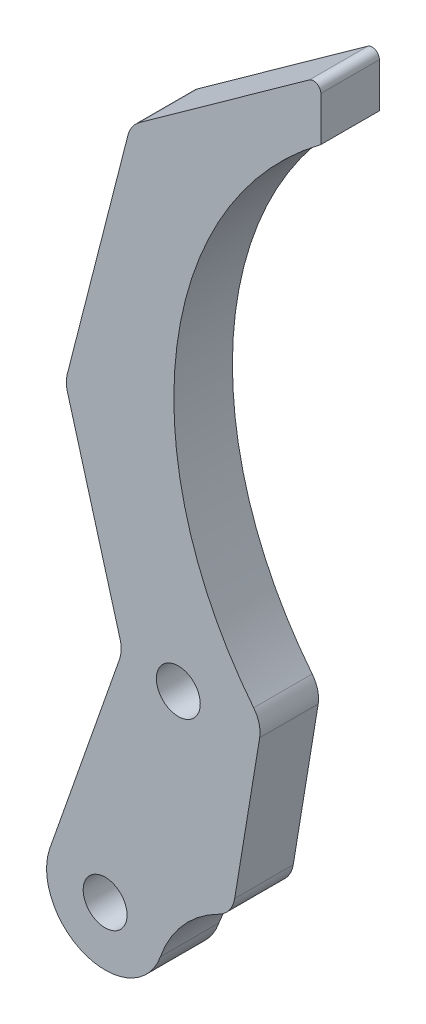
ISO-10303-21;
HEADER;
FILE_DESCRIPTION(('STEP AP214'),'2;1');
FILE_NAME('part.step','',(''),(''),'','','');
FILE_SCHEMA(('AUTOMOTIVE_DESIGN { 1 0 10303 214 1 1 1 1 }'));
ENDSEC;
DATA;
#1=APPLICATION_CONTEXT('core data for automotive mechanical design processes');
#2=APPLICATION_PROTOCOL_DEFINITION('international standard','automotive_design',2000,#1);
#3=PRODUCT_CONTEXT('',#1,'mechanical');
#4=PRODUCT('Part','Part','',(#3));
#5=PRODUCT_RELATED_PRODUCT_CATEGORY('part','',(#4));
#6=PRODUCT_DEFINITION_FORMATION('','',#4);
#7=PRODUCT_DEFINITION_CONTEXT('part definition',#1,'design');
#8=PRODUCT_DEFINITION('design','',#6,#7);
#9=PRODUCT_DEFINITION_SHAPE('','',#8);
#10=(LENGTH_UNIT() NAMED_UNIT(*) SI_UNIT(.MILLI.,.METRE.));
#11=(NAMED_UNIT(*) PLANE_ANGLE_UNIT() SI_UNIT($,.RADIAN.));
#12=(NAMED_UNIT(*) SI_UNIT($,.STERADIAN.) SOLID_ANGLE_UNIT());
#13=UNCERTAINTY_MEASURE_WITH_UNIT(LENGTH_MEASURE(1.E-05),#10,'distance_accuracy_value','');
#14=(GEOMETRIC_REPRESENTATION_CONTEXT(3) GLOBAL_UNCERTAINTY_ASSIGNED_CONTEXT((#13)) GLOBAL_UNIT_ASSIGNED_CONTEXT((#10,
#11,#12)) REPRESENTATION_CONTEXT('',''));
#15=CARTESIAN_POINT('',(0.,0.,0.));
#16=DIRECTION('',(0.,0.,1.));
#17=DIRECTION('',(1.,0.,0.));
#18=AXIS2_PLACEMENT_3D('',#15,#16,#17);
#19=CARTESIAN_POINT('',(3.02913563456561,50.8087252701093,4.));
#20=DIRECTION('',(0.,0.,-1.));
#21=DIRECTION('',(-1.,0.,0.));
#22=AXIS2_PLACEMENT_3D('',#19,#20,#21);
#23=PLANE('',#22);
#24=CARTESIAN_POINT('',(3.02913563456561,50.8087252701093,4.));
#25=DIRECTION('',(0.,0.,-1.));
#26=DIRECTION('',(-1.,0.,0.));
#27=AXIS2_PLACEMENT_3D('',#24,#25,#26);
#28=CIRCLE('',#27,25.);
#29=CARTESIAN_POINT('',(-16.5198445807297,35.2254851531762,4.));
#30=VERTEX_POINT('',#29);
#31=CARTESIAN_POINT('',(-11.927927268659,70.8408561929288,4.));
#32=VERTEX_POINT('',#31);
#33=EDGE_CURVE('E207',#30,#32,#28,.T.);
#34=ORIENTED_EDGE('',*,*,#33,.T.);
#35=DIRECTION('',(0.,1.,0.));
#36=VECTOR('',#35,1.);
#37=CARTESIAN_POINT('',(-11.927927268659,73.8667263637474,4.));
#38=LINE('',#37,#36);
#39=CARTESIAN_POINT('',(-11.927927268659,73.8667263637474,4.));
#40=VERTEX_POINT('',#39);
#41=EDGE_CURVE('E120',#32,#40,#38,.T.);
#42=ORIENTED_EDGE('',*,*,#41,.T.);
#43=CARTESIAN_POINT('',(-12.427927268659,73.8667263637474,4.));
#44=DIRECTION('',(0.,0.,1.));
#45=DIRECTION('',(-1.,0.,0.));
#46=AXIS2_PLACEMENT_3D('',#43,#44,#45);
#47=CIRCLE('',#46,0.499999999999995);
#48=CARTESIAN_POINT('',(-12.7194078185277,74.2729763964221,4.));
#49=VERTEX_POINT('',#48);
#50=EDGE_CURVE('E243',#40,#49,#47,.T.);
#51=ORIENTED_EDGE('',*,*,#50,.T.);
#52=DIRECTION('',(-0.812500065349455,-0.58296109973748,0.));
#53=VECTOR('',#52,1.);
#54=CARTESIAN_POINT('',(-24.3364766359972,65.9378395732082,4.));
#55=LINE('',#54,#53);
#56=CARTESIAN_POINT('',(-24.3364766359972,65.9378395732082,4.));
#57=VERTEX_POINT('',#56);
#58=EDGE_CURVE('E262',#49,#57,#55,.T.);
#59=ORIENTED_EDGE('',*,*,#58,.T.);
#60=CARTESIAN_POINT('',(-23.1705544365222,64.3128394425093,4.));
#61=DIRECTION('',(0.,0.,1.));
#62=DIRECTION('',(-1.,0.,0.));
#63=AXIS2_PLACEMENT_3D('',#60,#61,#62);
#64=CIRCLE('',#63,2.);
#65=CARTESIAN_POINT('',(-25.1082326082913,64.8082214190178,4.));
#66=VERTEX_POINT('',#65);
#67=EDGE_CURVE('E259',#57,#66,#64,.T.);
#68=ORIENTED_EDGE('',*,*,#67,.T.);
#69=DIRECTION('',(-0.247690988254264,-0.968839085884558,0.));
#70=VECTOR('',#69,1.);
#71=CARTESIAN_POINT('',(-29.2536289022766,48.5935743525241,4.));
#72=LINE('',#71,#70);
#73=CARTESIAN_POINT('',(-29.2536289022766,48.5935743525241,4.));
#74=VERTEX_POINT('',#73);
#75=EDGE_CURVE('E261',#66,#74,#72,.T.);
#76=ORIENTED_EDGE('',*,*,#75,.T.);
#77=CARTESIAN_POINT('',(-27.3159507305075,48.0981923760155,4.));
#78=DIRECTION('',(0.,0.,1.));
#79=DIRECTION('',(-1.,0.,0.));
#80=AXIS2_PLACEMENT_3D('',#77,#78,#79);
#81=CIRCLE('',#80,2.);
#82=CARTESIAN_POINT('',(-29.2417202398724,47.5583666663643,4.));
#83=VERTEX_POINT('',#82);
#84=EDGE_CURVE('E264',#74,#83,#81,.T.);
#85=ORIENTED_EDGE('',*,*,#84,.T.);
#86=DIRECTION('',(0.269912854825616,-0.962884754682452,0.));
#87=VECTOR('',#86,1.);
#88=CARTESIAN_POINT('',(-25.6428361003143,34.7197389022744,4.));
#89=LINE('',#88,#87);
#90=CARTESIAN_POINT('',(-25.6428361003143,34.7197389022744,4.));
#91=VERTEX_POINT('',#90);
#92=EDGE_CURVE('E270',#83,#91,#89,.T.);
#93=ORIENTED_EDGE('',*,*,#92,.T.);
#94=CARTESIAN_POINT('',(-27.5686056096793,34.1799131926231,4.));
#95=DIRECTION('',(0.,0.,-1.));
#96=DIRECTION('',(1.,0.,0.));
#97=AXIS2_PLACEMENT_3D('',#94,#95,#96);
#98=CIRCLE('',#97,2.);
#99=CARTESIAN_POINT('',(-25.6814762724612,33.5175365138287,4.));
#100=VERTEX_POINT('',#99);
#101=EDGE_CURVE('E272',#91,#100,#98,.T.);
#102=ORIENTED_EDGE('',*,*,#101,.T.);
#103=DIRECTION('',(-0.331188339397233,-0.943564668609048,0.));
#104=VECTOR('',#103,1.);
#105=CARTESIAN_POINT('',(-30.4404547988141,19.9590760791758,4.));
#106=LINE('',#105,#104);
#107=CARTESIAN_POINT('',(-30.4404547988141,19.9590760791758,4.));
#108=VERTEX_POINT('',#107);
#109=EDGE_CURVE('E274',#100,#108,#106,.T.);
#110=ORIENTED_EDGE('',*,*,#109,.T.);
#111=CARTESIAN_POINT('',(-26.6661944751087,18.6343221426984,4.));
#112=DIRECTION('',(0.,0.,1.));
#113=DIRECTION('',(1.,0.,0.));
#114=AXIS2_PLACEMENT_3D('',#111,#112,#113);
#115=CIRCLE('',#114,4.00000174791326);
#116=CARTESIAN_POINT('',(-22.8919341514033,17.309568206221,4.));
#117=VERTEX_POINT('',#116);
#118=EDGE_CURVE('E276',#108,#117,#115,.T.);
#119=ORIENTED_EDGE('',*,*,#118,.T.);
#120=CARTESIAN_POINT('',(-15.3434168025309,14.6600614910431,4.));
#121=DIRECTION('',(0.,0.,-1.));
#122=DIRECTION('',(-1.,0.,0.));
#123=AXIS2_PLACEMENT_3D('',#120,#121,#122);
#124=CIRCLE('',#123,8.);
#125=CARTESIAN_POINT('',(-18.8990856555673,21.8264566104561,4.));
#126=VERTEX_POINT('',#125);
#127=EDGE_CURVE('E160',#117,#126,#124,.T.);
#128=ORIENTED_EDGE('',*,*,#127,.T.);
#129=CARTESIAN_POINT('',(-19.7880028688264,23.6180553903094,4.));
#130=DIRECTION('',(0.,0.,1.));
#131=DIRECTION('',(1.,0.,0.));
#132=AXIS2_PLACEMENT_3D('',#129,#130,#131);
#133=CIRCLE('',#132,2.);
#134=CARTESIAN_POINT('',(-17.8145227633955,23.2934382720478,4.));
#135=VERTEX_POINT('',#134);
#136=EDGE_CURVE('E154',#126,#135,#133,.T.);
#137=ORIENTED_EDGE('',*,*,#136,.T.);
#138=DIRECTION('',(0.162308559130773,0.986740052715452,0.));
#139=VECTOR('',#138,1.);
#140=CARTESIAN_POINT('',(-16.1102828925224,33.65420882556,4.));
#141=LINE('',#140,#139);
#142=CARTESIAN_POINT('',(-16.1102828925224,33.65420882556,4.));
#143=VERTEX_POINT('',#142);
#144=EDGE_CURVE('E158',#135,#143,#141,.T.);
#145=ORIENTED_EDGE('',*,*,#144,.T.);
#146=CARTESIAN_POINT('',(-18.0837629979533,33.9788259438216,4.));
#147=DIRECTION('',(0.,0.,1.));
#148=DIRECTION('',(1.,0.,0.));
#149=AXIS2_PLACEMENT_3D('',#146,#147,#148);
#150=CIRCLE('',#149,2.);
#151=EDGE_CURVE('E56',#143,#30,#150,.T.);
#152=ORIENTED_EDGE('',*,*,#151,.T.);
#153=EDGE_LOOP('',(#34,#42,#51,#59,#68,#76,#85,#93,#102,#110,#119,#128,#137,#145,#152));
#154=FACE_BOUND('',#153,.T.);
#155=CARTESIAN_POINT('',(-26.6661944751087,18.6343221426984,4.));
#156=DIRECTION('',(0.,0.,1.));
#157=DIRECTION('',(-1.,0.,0.));
#158=AXIS2_PLACEMENT_3D('',#155,#156,#157);
#159=CIRCLE('',#158,1.5);
#160=CARTESIAN_POINT('',(-28.1661944751087,18.6343221426984,4.));
#161=VERTEX_POINT('',#160);
#162=EDGE_CURVE('E182',#161,#161,#159,.T.);
#163=ORIENTED_EDGE('',*,*,#162,.F.);
#164=EDGE_LOOP('',(#163));
#165=FACE_BOUND('',#164,.T.);
#166=CARTESIAN_POINT('',(-21.6661944751087,33.6343221426984,4.));
#167=DIRECTION('',(0.,0.,1.));
#168=DIRECTION('',(1.,0.,0.));
#169=AXIS2_PLACEMENT_3D('',#166,#167,#168);
#170=CIRCLE('',#169,1.5);
#171=CARTESIAN_POINT('',(-20.1661944751087,33.6343221426984,4.));
#172=VERTEX_POINT('',#171);
#173=EDGE_CURVE('E317',#172,#172,#170,.T.);
#174=ORIENTED_EDGE('',*,*,#173,.F.);
#175=EDGE_LOOP('',(#174));
#176=FACE_BOUND('',#175,.T.);
#177=ADVANCED_FACE('F39',(#154,#165,#176),#23,.F.);
#178=CARTESIAN_POINT('',(3.02913563456561,50.8087252701093,0.));
#179=DIRECTION('',(0.,0.,-1.));
#180=DIRECTION('',(-1.,0.,0.));
#181=AXIS2_PLACEMENT_3D('',#178,#179,#180);
#182=PLANE('',#181);
#183=CARTESIAN_POINT('',(-26.6661944751087,18.6343221426984,0.));
#184=DIRECTION('',(0.,0.,1.));
#185=DIRECTION('',(-1.,0.,0.));
#186=AXIS2_PLACEMENT_3D('',#183,#184,#185);
#187=CIRCLE('',#186,1.5);
#188=CARTESIAN_POINT('',(-28.1661944751087,18.6343221426984,0.));
#189=VERTEX_POINT('',#188);
#190=EDGE_CURVE('E322',#189,#189,#187,.T.);
#191=ORIENTED_EDGE('',*,*,#190,.T.);
#192=EDGE_LOOP('',(#191));
#193=FACE_BOUND('',#192,.T.);
#194=CARTESIAN_POINT('',(3.02913563456561,50.8087252701093,0.));
#195=DIRECTION('',(0.,0.,-1.));
#196=DIRECTION('',(-1.,0.,0.));
#197=AXIS2_PLACEMENT_3D('',#194,#195,#196);
#198=CIRCLE('',#197,25.);
#199=CARTESIAN_POINT('',(-16.5198445807297,35.2254851531762,0.));
#200=VERTEX_POINT('',#199);
#201=CARTESIAN_POINT('',(-11.927927268659,70.8408561929288,0.));
#202=VERTEX_POINT('',#201);
#203=EDGE_CURVE('E178',#200,#202,#198,.T.);
#204=ORIENTED_EDGE('',*,*,#203,.F.);
#205=CARTESIAN_POINT('',(-18.0837629979533,33.9788259438216,0.));
#206=DIRECTION('',(0.,0.,1.));
#207=DIRECTION('',(1.,0.,0.));
#208=AXIS2_PLACEMENT_3D('',#205,#206,#207);
#209=CIRCLE('',#208,2.);
#210=CARTESIAN_POINT('',(-16.1102828925224,33.65420882556,0.));
#211=VERTEX_POINT('',#210);
#212=EDGE_CURVE('E112',#211,#200,#209,.T.);
#213=ORIENTED_EDGE('',*,*,#212,.F.);
#214=DIRECTION('',(0.162308559130773,0.986740052715452,0.));
#215=VECTOR('',#214,1.);
#216=CARTESIAN_POINT('',(-16.1102828925224,33.65420882556,0.));
#217=LINE('',#216,#215);
#218=CARTESIAN_POINT('',(-17.8145227633955,23.2934382720478,0.));
#219=VERTEX_POINT('',#218);
#220=EDGE_CURVE('E106',#219,#211,#217,.T.);
#221=ORIENTED_EDGE('',*,*,#220,.F.);
#222=CARTESIAN_POINT('',(-19.7880028688264,23.6180553903094,0.));
#223=DIRECTION('',(0.,0.,1.));
#224=DIRECTION('',(1.,0.,0.));
#225=AXIS2_PLACEMENT_3D('',#222,#223,#224);
#226=CIRCLE('',#225,2.);
#227=CARTESIAN_POINT('',(-18.8990856555673,21.8264566104561,0.));
#228=VERTEX_POINT('',#227);
#229=EDGE_CURVE('E168',#228,#219,#226,.T.);
#230=ORIENTED_EDGE('',*,*,#229,.F.);
#231=CARTESIAN_POINT('',(-15.3434168025309,14.6600614910431,0.));
#232=DIRECTION('',(0.,0.,-1.));
#233=DIRECTION('',(-1.,0.,0.));
#234=AXIS2_PLACEMENT_3D('',#231,#232,#233);
#235=CIRCLE('',#234,8.);
#236=CARTESIAN_POINT('',(-22.8919341514033,17.309568206221,0.));
#237=VERTEX_POINT('',#236);
#238=EDGE_CURVE('E202',#237,#228,#235,.T.);
#239=ORIENTED_EDGE('',*,*,#238,.F.);
#240=CARTESIAN_POINT('',(-26.6661944751087,18.6343221426984,0.));
#241=DIRECTION('',(0.,0.,1.));
#242=DIRECTION('',(1.,0.,0.));
#243=AXIS2_PLACEMENT_3D('',#240,#241,#242);
#244=CIRCLE('',#243,4.00000174791326);
#245=CARTESIAN_POINT('',(-30.4404547988141,19.9590760791758,0.));
#246=VERTEX_POINT('',#245);
#247=EDGE_CURVE('E200',#246,#237,#244,.T.);
#248=ORIENTED_EDGE('',*,*,#247,.F.);
#249=DIRECTION('',(-0.331188339397233,-0.943564668609048,0.));
#250=VECTOR('',#249,1.);
#251=CARTESIAN_POINT('',(-30.4404547988141,19.9590760791758,0.));
#252=LINE('',#251,#250);
#253=CARTESIAN_POINT('',(-25.6814762724612,33.5175365138287,0.));
#254=VERTEX_POINT('',#253);
#255=EDGE_CURVE('E198',#254,#246,#252,.T.);
#256=ORIENTED_EDGE('',*,*,#255,.F.);
#257=CARTESIAN_POINT('',(-27.5686056096793,34.1799131926231,0.));
#258=DIRECTION('',(0.,0.,-1.));
#259=DIRECTION('',(1.,0.,0.));
#260=AXIS2_PLACEMENT_3D('',#257,#258,#259);
#261=CIRCLE('',#260,2.);
#262=CARTESIAN_POINT('',(-25.6428361003143,34.7197389022744,0.));
#263=VERTEX_POINT('',#262);
#264=EDGE_CURVE('E196',#263,#254,#261,.T.);
#265=ORIENTED_EDGE('',*,*,#264,.F.);
#266=DIRECTION('',(0.269912854825616,-0.962884754682452,0.));
#267=VECTOR('',#266,1.);
#268=CARTESIAN_POINT('',(-25.6428361003143,34.7197389022744,0.));
#269=LINE('',#268,#267);
#270=CARTESIAN_POINT('',(-29.2417202398724,47.5583666663643,0.));
#271=VERTEX_POINT('',#270);
#272=EDGE_CURVE('E194',#271,#263,#269,.T.);
#273=ORIENTED_EDGE('',*,*,#272,.F.);
#274=CARTESIAN_POINT('',(-27.3159507305075,48.0981923760155,0.));
#275=DIRECTION('',(0.,0.,1.));
#276=DIRECTION('',(-1.,0.,0.));
#277=AXIS2_PLACEMENT_3D('',#274,#275,#276);
#278=CIRCLE('',#277,2.);
#279=CARTESIAN_POINT('',(-29.2536289022766,48.5935743525241,0.));
#280=VERTEX_POINT('',#279);
#281=EDGE_CURVE('E192',#280,#271,#278,.T.);
#282=ORIENTED_EDGE('',*,*,#281,.F.);
#283=DIRECTION('',(-0.247690988254264,-0.968839085884558,0.));
#284=VECTOR('',#283,1.);
#285=CARTESIAN_POINT('',(-29.2536289022766,48.5935743525241,0.));
#286=LINE('',#285,#284);
#287=CARTESIAN_POINT('',(-25.1082326082913,64.8082214190178,0.));
#288=VERTEX_POINT('',#287);
#289=EDGE_CURVE('E190',#288,#280,#286,.T.);
#290=ORIENTED_EDGE('',*,*,#289,.F.);
#291=CARTESIAN_POINT('',(-23.1705544365222,64.3128394425093,0.));
#292=DIRECTION('',(0.,0.,1.));
#293=DIRECTION('',(-1.,0.,0.));
#294=AXIS2_PLACEMENT_3D('',#291,#292,#293);
#295=CIRCLE('',#294,2.);
#296=CARTESIAN_POINT('',(-24.3364766359972,65.9378395732082,0.));
#297=VERTEX_POINT('',#296);
#298=EDGE_CURVE('E188',#297,#288,#295,.T.);
#299=ORIENTED_EDGE('',*,*,#298,.F.);
#300=DIRECTION('',(-0.812500065349455,-0.58296109973748,0.));
#301=VECTOR('',#300,1.);
#302=CARTESIAN_POINT('',(-24.3364766359972,65.9378395732082,0.));
#303=LINE('',#302,#301);
#304=CARTESIAN_POINT('',(-12.7194078185277,74.2729763964221,0.));
#305=VERTEX_POINT('',#304);
#306=EDGE_CURVE('E186',#305,#297,#303,.T.);
#307=ORIENTED_EDGE('',*,*,#306,.F.);
#308=CARTESIAN_POINT('',(-12.427927268659,73.8667263637474,0.));
#309=DIRECTION('',(0.,0.,1.));
#310=DIRECTION('',(-1.,0.,0.));
#311=AXIS2_PLACEMENT_3D('',#308,#309,#310);
#312=CIRCLE('',#311,0.499999999999995);
#313=CARTESIAN_POINT('',(-11.927927268659,73.8667263637474,0.));
#314=VERTEX_POINT('',#313);
#315=EDGE_CURVE('E184',#314,#305,#312,.T.);
#316=ORIENTED_EDGE('',*,*,#315,.F.);
#317=DIRECTION('',(0.,1.,0.));
#318=VECTOR('',#317,1.);
#319=CARTESIAN_POINT('',(-11.927927268659,73.8667263637474,0.));
#320=LINE('',#319,#318);
#321=EDGE_CURVE('E181',#202,#314,#320,.T.);
#322=ORIENTED_EDGE('',*,*,#321,.F.);
#323=EDGE_LOOP('',(#204,#213,#221,#230,#239,#248,#256,#265,#273,#282,#290,#299,#307,#316,#322));
#324=FACE_BOUND('',#323,.T.);
#325=CARTESIAN_POINT('',(-21.6661944751087,33.6343221426984,0.));
#326=DIRECTION('',(0.,0.,1.));
#327=DIRECTION('',(1.,0.,0.));
#328=AXIS2_PLACEMENT_3D('',#325,#326,#327);
#329=CIRCLE('',#328,1.5);
#330=CARTESIAN_POINT('',(-20.1661944751087,33.6343221426984,0.));
#331=VERTEX_POINT('',#330);
#332=EDGE_CURVE('E320',#331,#331,#329,.T.);
#333=ORIENTED_EDGE('',*,*,#332,.T.);
#334=EDGE_LOOP('',(#333));
#335=FACE_BOUND('',#334,.T.);
#336=ADVANCED_FACE('F247',(#193,#324,#335),#182,.T.);
#337=CARTESIAN_POINT('',(3.02913563456561,50.8087252701093,4.));
#338=DIRECTION('',(0.,0.,-1.));
#339=DIRECTION('',(-1.,0.,0.));
#340=AXIS2_PLACEMENT_3D('',#337,#338,#339);
#341=CYLINDRICAL_SURFACE('',#340,25.);
#342=ORIENTED_EDGE('',*,*,#203,.T.);
#343=DIRECTION('',(0.,0.,-1.));
#344=VECTOR('',#343,1.);
#345=CARTESIAN_POINT('',(-11.927927268659,70.8408561929288,4.));
#346=LINE('',#345,#344);
#347=EDGE_CURVE('E11',#32,#202,#346,.T.);
#348=ORIENTED_EDGE('',*,*,#347,.F.);
#349=ORIENTED_EDGE('',*,*,#33,.F.);
#350=DIRECTION('',(0.,0.,-1.));
#351=VECTOR('',#350,1.);
#352=CARTESIAN_POINT('',(-16.5198445807297,35.2254851531762,4.));
#353=LINE('',#352,#351);
#354=EDGE_CURVE('E174',#30,#200,#353,.T.);
#355=ORIENTED_EDGE('',*,*,#354,.T.);
#356=EDGE_LOOP('',(#342,#348,#349,#355));
#357=FACE_BOUND('',#356,.T.);
#358=ADVANCED_FACE('F41',(#357),#341,.F.);
#359=CARTESIAN_POINT('',(-11.927927268659,73.8667263637474,4.));
#360=DIRECTION('',(-1.,0.,0.));
#361=DIRECTION('',(0.,0.,1.));
#362=AXIS2_PLACEMENT_3D('',#359,#360,#361);
#363=PLANE('',#362);
#364=ORIENTED_EDGE('',*,*,#321,.T.);
#365=DIRECTION('',(0.,0.,-1.));
#366=VECTOR('',#365,1.);
#367=CARTESIAN_POINT('',(-11.927927268659,73.8667263637474,4.));
#368=LINE('',#367,#366);
#369=EDGE_CURVE('E48',#40,#314,#368,.T.);
#370=ORIENTED_EDGE('',*,*,#369,.F.);
#371=ORIENTED_EDGE('',*,*,#41,.F.);
#372=ORIENTED_EDGE('',*,*,#347,.T.);
#373=EDGE_LOOP('',(#364,#370,#371,#372));
#374=FACE_BOUND('',#373,.T.);
#375=ADVANCED_FACE('F447',(#374),#363,.F.);
#376=CARTESIAN_POINT('',(-12.427927268659,73.8667263637474,4.));
#377=DIRECTION('',(0.,0.,-1.));
#378=DIRECTION('',(-1.,0.,0.));
#379=AXIS2_PLACEMENT_3D('',#376,#377,#378);
#380=CYLINDRICAL_SURFACE('',#379,0.499999999999995);
#381=ORIENTED_EDGE('',*,*,#315,.T.);
#382=DIRECTION('',(0.,0.,-1.));
#383=VECTOR('',#382,1.);
#384=CARTESIAN_POINT('',(-12.7194078185277,74.2729763964221,4.));
#385=LINE('',#384,#383);
#386=EDGE_CURVE('E235',#49,#305,#385,.T.);
#387=ORIENTED_EDGE('',*,*,#386,.F.);
#388=ORIENTED_EDGE('',*,*,#50,.F.);
#389=ORIENTED_EDGE('',*,*,#369,.T.);
#390=EDGE_LOOP('',(#381,#387,#388,#389));
#391=FACE_BOUND('',#390,.T.);
#392=ADVANCED_FACE('F241',(#391),#380,.T.);
#393=CARTESIAN_POINT('',(-24.3364766359972,65.9378395732082,4.));
#394=DIRECTION('',(0.58296109973748,-0.812500065349455,0.));
#395=DIRECTION('',(0.812500065349455,0.58296109973748,0.));
#396=AXIS2_PLACEMENT_3D('',#393,#394,#395);
#397=PLANE('',#396);
#398=ORIENTED_EDGE('',*,*,#306,.T.);
#399=DIRECTION('',(0.,0.,-1.));
#400=VECTOR('',#399,1.);
#401=CARTESIAN_POINT('',(-24.3364766359972,65.9378395732082,4.));
#402=LINE('',#401,#400);
#403=EDGE_CURVE('E232',#57,#297,#402,.T.);
#404=ORIENTED_EDGE('',*,*,#403,.F.);
#405=ORIENTED_EDGE('',*,*,#58,.F.);
#406=ORIENTED_EDGE('',*,*,#386,.T.);
#407=EDGE_LOOP('',(#398,#404,#405,#406));
#408=FACE_BOUND('',#407,.T.);
#409=ADVANCED_FACE('F253',(#408),#397,.F.);
#410=CARTESIAN_POINT('',(-23.1705544365222,64.3128394425093,4.));
#411=DIRECTION('',(0.,0.,-1.));
#412=DIRECTION('',(-1.,0.,0.));
#413=AXIS2_PLACEMENT_3D('',#410,#411,#412);
#414=CYLINDRICAL_SURFACE('',#413,2.);
#415=ORIENTED_EDGE('',*,*,#298,.T.);
#416=DIRECTION('',(0.,0.,-1.));
#417=VECTOR('',#416,1.);
#418=CARTESIAN_POINT('',(-25.1082326082913,64.8082214190178,4.));
#419=LINE('',#418,#417);
#420=EDGE_CURVE('E229',#66,#288,#419,.T.);
#421=ORIENTED_EDGE('',*,*,#420,.F.);
#422=ORIENTED_EDGE('',*,*,#67,.F.);
#423=ORIENTED_EDGE('',*,*,#403,.T.);
#424=EDGE_LOOP('',(#415,#421,#422,#423));
#425=FACE_BOUND('',#424,.T.);
#426=ADVANCED_FACE('F257',(#425),#414,.T.);
#427=CARTESIAN_POINT('',(-29.2536289022766,48.5935743525241,4.));
#428=DIRECTION('',(0.968839085884558,-0.247690988254264,0.));
#429=DIRECTION('',(0.247690988254264,0.968839085884558,0.));
#430=AXIS2_PLACEMENT_3D('',#427,#428,#429);
#431=PLANE('',#430);
#432=ORIENTED_EDGE('',*,*,#289,.T.);
#433=DIRECTION('',(0.,0.,-1.));
#434=VECTOR('',#433,1.);
#435=CARTESIAN_POINT('',(-29.2536289022766,48.5935743525241,4.));
#436=LINE('',#435,#434);
#437=EDGE_CURVE('E226',#74,#280,#436,.T.);
#438=ORIENTED_EDGE('',*,*,#437,.F.);
#439=ORIENTED_EDGE('',*,*,#75,.F.);
#440=ORIENTED_EDGE('',*,*,#420,.T.);
#441=EDGE_LOOP('',(#432,#438,#439,#440));
#442=FACE_BOUND('',#441,.T.);
#443=ADVANCED_FACE('F412',(#442),#431,.F.);
#444=CARTESIAN_POINT('',(-27.3159507305075,48.0981923760155,4.));
#445=DIRECTION('',(0.,0.,-1.));
#446=DIRECTION('',(-1.,0.,0.));
#447=AXIS2_PLACEMENT_3D('',#444,#445,#446);
#448=CYLINDRICAL_SURFACE('',#447,2.);
#449=ORIENTED_EDGE('',*,*,#281,.T.);
#450=DIRECTION('',(0.,0.,-1.));
#451=VECTOR('',#450,1.);
#452=CARTESIAN_POINT('',(-29.2417202398724,47.5583666663643,4.));
#453=LINE('',#452,#451);
#454=EDGE_CURVE('E223',#83,#271,#453,.T.);
#455=ORIENTED_EDGE('',*,*,#454,.F.);
#456=ORIENTED_EDGE('',*,*,#84,.F.);
#457=ORIENTED_EDGE('',*,*,#437,.T.);
#458=EDGE_LOOP('',(#449,#455,#456,#457));
#459=FACE_BOUND('',#458,.T.);
#460=ADVANCED_FACE('F402',(#459),#448,.T.);
#461=CARTESIAN_POINT('',(-25.6428361003143,34.7197389022744,4.));
#462=DIRECTION('',(0.962884754682452,0.269912854825616,0.));
#463=DIRECTION('',(-0.269912854825616,0.962884754682452,0.));
#464=AXIS2_PLACEMENT_3D('',#461,#462,#463);
#465=PLANE('',#464);
#466=ORIENTED_EDGE('',*,*,#272,.T.);
#467=DIRECTION('',(0.,0.,-1.));
#468=VECTOR('',#467,1.);
#469=CARTESIAN_POINT('',(-25.6428361003143,34.7197389022744,4.));
#470=LINE('',#469,#468);
#471=EDGE_CURVE('E220',#91,#263,#470,.T.);
#472=ORIENTED_EDGE('',*,*,#471,.F.);
#473=ORIENTED_EDGE('',*,*,#92,.F.);
#474=ORIENTED_EDGE('',*,*,#454,.T.);
#475=EDGE_LOOP('',(#466,#472,#473,#474));
#476=FACE_BOUND('',#475,.T.);
#477=ADVANCED_FACE('F392',(#476),#465,.F.);
#478=CARTESIAN_POINT('',(-27.5686056096793,34.1799131926231,4.));
#479=DIRECTION('',(0.,0.,-1.));
#480=DIRECTION('',(-1.,0.,0.));
#481=AXIS2_PLACEMENT_3D('',#478,#479,#480);
#482=CYLINDRICAL_SURFACE('',#481,2.);
#483=ORIENTED_EDGE('',*,*,#264,.T.);
#484=DIRECTION('',(0.,0.,-1.));
#485=VECTOR('',#484,1.);
#486=CARTESIAN_POINT('',(-25.6814762724612,33.5175365138287,4.));
#487=LINE('',#486,#485);
#488=EDGE_CURVE('E217',#100,#254,#487,.T.);
#489=ORIENTED_EDGE('',*,*,#488,.F.);
#490=ORIENTED_EDGE('',*,*,#101,.F.);
#491=ORIENTED_EDGE('',*,*,#471,.T.);
#492=EDGE_LOOP('',(#483,#489,#490,#491));
#493=FACE_BOUND('',#492,.T.);
#494=ADVANCED_FACE('F382',(#493),#482,.F.);
#495=CARTESIAN_POINT('',(-30.4404547988141,19.9590760791758,4.));
#496=DIRECTION('',(0.943564668609048,-0.331188339397233,0.));
#497=DIRECTION('',(0.331188339397233,0.943564668609048,0.));
#498=AXIS2_PLACEMENT_3D('',#495,#496,#497);
#499=PLANE('',#498);
#500=ORIENTED_EDGE('',*,*,#255,.T.);
#501=DIRECTION('',(0.,0.,-1.));
#502=VECTOR('',#501,1.);
#503=CARTESIAN_POINT('',(-30.4404547988141,19.9590760791758,4.));
#504=LINE('',#503,#502);
#505=EDGE_CURVE('E214',#108,#246,#504,.T.);
#506=ORIENTED_EDGE('',*,*,#505,.F.);
#507=ORIENTED_EDGE('',*,*,#109,.F.);
#508=ORIENTED_EDGE('',*,*,#488,.T.);
#509=EDGE_LOOP('',(#500,#506,#507,#508));
#510=FACE_BOUND('',#509,.T.);
#511=ADVANCED_FACE('F373',(#510),#499,.F.);
#512=CARTESIAN_POINT('',(-26.6661944751087,18.6343221426984,4.));
#513=DIRECTION('',(0.,0.,-1.));
#514=DIRECTION('',(-1.,0.,0.));
#515=AXIS2_PLACEMENT_3D('',#512,#513,#514);
#516=CYLINDRICAL_SURFACE('',#515,4.00000174791326);
#517=ORIENTED_EDGE('',*,*,#247,.T.);
#518=DIRECTION('',(0.,0.,-1.));
#519=VECTOR('',#518,1.);
#520=CARTESIAN_POINT('',(-22.8919341514033,17.309568206221,4.));
#521=LINE('',#520,#519);
#522=EDGE_CURVE('E211',#117,#237,#521,.T.);
#523=ORIENTED_EDGE('',*,*,#522,.F.);
#524=ORIENTED_EDGE('',*,*,#118,.F.);
#525=ORIENTED_EDGE('',*,*,#505,.T.);
#526=EDGE_LOOP('',(#517,#523,#524,#525));
#527=FACE_BOUND('',#526,.T.);
#528=ADVANCED_FACE('F282',(#527),#516,.T.);
#529=CARTESIAN_POINT('',(-15.3434168025309,14.6600614910431,4.));
#530=DIRECTION('',(0.,0.,-1.));
#531=DIRECTION('',(-1.,0.,0.));
#532=AXIS2_PLACEMENT_3D('',#529,#530,#531);
#533=CYLINDRICAL_SURFACE('',#532,8.);
#534=ORIENTED_EDGE('',*,*,#238,.T.);
#535=DIRECTION('',(0.,0.,-1.));
#536=VECTOR('',#535,1.);
#537=CARTESIAN_POINT('',(-18.8990856555673,21.8264566104561,4.));
#538=LINE('',#537,#536);
#539=EDGE_CURVE('E169',#126,#228,#538,.T.);
#540=ORIENTED_EDGE('',*,*,#539,.F.);
#541=ORIENTED_EDGE('',*,*,#127,.F.);
#542=ORIENTED_EDGE('',*,*,#522,.T.);
#543=EDGE_LOOP('',(#534,#540,#541,#542));
#544=FACE_BOUND('',#543,.T.);
#545=ADVANCED_FACE('F286',(#544),#533,.F.);
#546=CARTESIAN_POINT('',(-19.7880028688264,23.6180553903094,4.));
#547=DIRECTION('',(0.,0.,-1.));
#548=DIRECTION('',(-1.,0.,0.));
#549=AXIS2_PLACEMENT_3D('',#546,#547,#548);
#550=CYLINDRICAL_SURFACE('',#549,2.);
#551=ORIENTED_EDGE('',*,*,#229,.T.);
#552=DIRECTION('',(0.,0.,-1.));
#553=VECTOR('',#552,1.);
#554=CARTESIAN_POINT('',(-17.8145227633955,23.2934382720478,4.));
#555=LINE('',#554,#553);
#556=EDGE_CURVE('E165',#135,#219,#555,.T.);
#557=ORIENTED_EDGE('',*,*,#556,.F.);
#558=ORIENTED_EDGE('',*,*,#136,.F.);
#559=ORIENTED_EDGE('',*,*,#539,.T.);
#560=EDGE_LOOP('',(#551,#557,#558,#559));
#561=FACE_BOUND('',#560,.T.);
#562=ADVANCED_FACE('F166',(#561),#550,.T.);
#563=CARTESIAN_POINT('',(-16.1102828925224,33.65420882556,4.));
#564=DIRECTION('',(-0.986740052715452,0.162308559130773,0.));
#565=DIRECTION('',(-0.162308559130773,-0.986740052715452,0.));
#566=AXIS2_PLACEMENT_3D('',#563,#564,#565);
#567=PLANE('',#566);
#568=ORIENTED_EDGE('',*,*,#220,.T.);
#569=DIRECTION('',(0.,0.,-1.));
#570=VECTOR('',#569,1.);
#571=CARTESIAN_POINT('',(-16.1102828925224,33.65420882556,4.));
#572=LINE('',#571,#570);
#573=EDGE_CURVE('E170',#143,#211,#572,.T.);
#574=ORIENTED_EDGE('',*,*,#573,.F.);
#575=ORIENTED_EDGE('',*,*,#144,.F.);
#576=ORIENTED_EDGE('',*,*,#556,.T.);
#577=EDGE_LOOP('',(#568,#574,#575,#576));
#578=FACE_BOUND('',#577,.T.);
#579=ADVANCED_FACE('F172',(#578),#567,.F.);
#580=CARTESIAN_POINT('',(-18.0837629979533,33.9788259438216,4.));
#581=DIRECTION('',(0.,0.,-1.));
#582=DIRECTION('',(-1.,0.,0.));
#583=AXIS2_PLACEMENT_3D('',#580,#581,#582);
#584=CYLINDRICAL_SURFACE('',#583,2.);
#585=ORIENTED_EDGE('',*,*,#212,.T.);
#586=ORIENTED_EDGE('',*,*,#354,.F.);
#587=ORIENTED_EDGE('',*,*,#151,.F.);
#588=ORIENTED_EDGE('',*,*,#573,.T.);
#589=EDGE_LOOP('',(#585,#586,#587,#588));
#590=FACE_BOUND('',#589,.T.);
#591=ADVANCED_FACE('F290',(#590),#584,.T.);
#592=CARTESIAN_POINT('',(-26.6661944751087,18.6343221426984,4.));
#593=DIRECTION('',(0.,0.,-1.));
#594=DIRECTION('',(-1.,0.,0.));
#595=AXIS2_PLACEMENT_3D('',#592,#593,#594);
#596=CYLINDRICAL_SURFACE('',#595,1.5);
#597=ORIENTED_EDGE('',*,*,#162,.T.);
#598=EDGE_LOOP('',(#597));
#599=FACE_BOUND('',#598,.T.);
#600=ORIENTED_EDGE('',*,*,#190,.F.);
#601=EDGE_LOOP('',(#600));
#602=FACE_BOUND('',#601,.T.);
#603=ADVANCED_FACE('F292',(#599,#602),#596,.F.);
#604=CARTESIAN_POINT('',(-21.6661944751087,33.6343221426984,4.));
#605=DIRECTION('',(0.,0.,-1.));
#606=DIRECTION('',(-1.,0.,0.));
#607=AXIS2_PLACEMENT_3D('',#604,#605,#606);
#608=CYLINDRICAL_SURFACE('',#607,1.5);
#609=ORIENTED_EDGE('',*,*,#173,.T.);
#610=EDGE_LOOP('',(#609));
#611=FACE_BOUND('',#610,.T.);
#612=ORIENTED_EDGE('',*,*,#332,.F.);
#613=EDGE_LOOP('',(#612));
#614=FACE_BOUND('',#613,.T.);
#615=ADVANCED_FACE('F298',(#611,#614),#608,.F.);
#616=CLOSED_SHELL('',(#177,#336,#358,#375,#392,#409,#426,#443,#460,#477,#494,#511,#528,#545,
#562,#579,#591,#603,#615));
#617=MANIFOLD_SOLID_BREP('B2',#616);
#618=ADVANCED_BREP_SHAPE_REPRESENTATION('',(#18,#617),#14);
#619=SHAPE_DEFINITION_REPRESENTATION(#9,#618);
ENDSEC;
END-ISO-10303-21;
